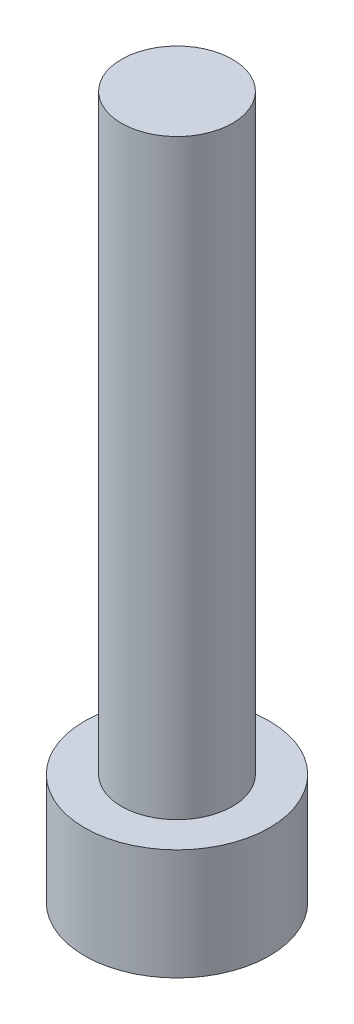
ISO-10303-21;
HEADER;
FILE_DESCRIPTION(('STEP AP214'),'2;1');
FILE_NAME('part.step','',(''),(''),'','','');
FILE_SCHEMA(('AUTOMOTIVE_DESIGN { 1 0 10303 214 1 1 1 1 }'));
ENDSEC;
DATA;
#1=APPLICATION_CONTEXT('core data for automotive mechanical design processes');
#2=APPLICATION_PROTOCOL_DEFINITION('international standard','automotive_design',2000,#1);
#3=PRODUCT_CONTEXT('',#1,'mechanical');
#4=PRODUCT('Part','Part','',(#3));
#5=PRODUCT_RELATED_PRODUCT_CATEGORY('part','',(#4));
#6=PRODUCT_DEFINITION_FORMATION('','',#4);
#7=PRODUCT_DEFINITION_CONTEXT('part definition',#1,'design');
#8=PRODUCT_DEFINITION('design','',#6,#7);
#9=PRODUCT_DEFINITION_SHAPE('','',#8);
#10=(LENGTH_UNIT() NAMED_UNIT(*) SI_UNIT(.MILLI.,.METRE.));
#11=(NAMED_UNIT(*) PLANE_ANGLE_UNIT() SI_UNIT($,.RADIAN.));
#12=(NAMED_UNIT(*) SI_UNIT($,.STERADIAN.) SOLID_ANGLE_UNIT());
#13=UNCERTAINTY_MEASURE_WITH_UNIT(LENGTH_MEASURE(1.E-05),#10,'distance_accuracy_value','');
#14=(GEOMETRIC_REPRESENTATION_CONTEXT(3) GLOBAL_UNCERTAINTY_ASSIGNED_CONTEXT((#13)) GLOBAL_UNIT_ASSIGNED_CONTEXT((#10,
#11,#12)) REPRESENTATION_CONTEXT('',''));
#15=CARTESIAN_POINT('',(0.,0.,0.));
#16=DIRECTION('',(0.,0.,1.));
#17=DIRECTION('',(1.,0.,0.));
#18=AXIS2_PLACEMENT_3D('',#15,#16,#17);
#19=CARTESIAN_POINT('',(0.,3.,0.));
#20=DIRECTION('',(0.,-1.,0.));
#21=DIRECTION('',(0.,0.,-1.));
#22=AXIS2_PLACEMENT_3D('',#19,#20,#21);
#23=CYLINDRICAL_SURFACE('',#22,2.5);
#24=CARTESIAN_POINT('',(0.,3.,0.));
#25=DIRECTION('',(0.,1.,0.));
#26=DIRECTION('',(0.,0.,1.));
#27=AXIS2_PLACEMENT_3D('',#24,#25,#26);
#28=CIRCLE('',#27,2.5);
#29=CARTESIAN_POINT('',(0.,3.,2.5));
#30=VERTEX_POINT('',#29);
#31=EDGE_CURVE('E43',#30,#30,#28,.T.);
#32=ORIENTED_EDGE('',*,*,#31,.F.);
#33=EDGE_LOOP('',(#32));
#34=FACE_BOUND('',#33,.T.);
#35=CARTESIAN_POINT('',(0.,0.,0.));
#36=DIRECTION('',(0.,1.,0.));
#37=DIRECTION('',(0.,0.,1.));
#38=AXIS2_PLACEMENT_3D('',#35,#36,#37);
#39=CIRCLE('',#38,2.5);
#40=CARTESIAN_POINT('',(0.,0.,2.5));
#41=VERTEX_POINT('',#40);
#42=EDGE_CURVE('E38',#41,#41,#39,.T.);
#43=ORIENTED_EDGE('',*,*,#42,.T.);
#44=EDGE_LOOP('',(#43));
#45=FACE_BOUND('',#44,.T.);
#46=ADVANCED_FACE('F35',(#34,#45),#23,.T.);
#47=CARTESIAN_POINT('',(0.,3.,0.));
#48=DIRECTION('',(0.,1.,0.));
#49=DIRECTION('',(0.,0.,1.));
#50=AXIS2_PLACEMENT_3D('',#47,#48,#49);
#51=PLANE('',#50);
#52=CARTESIAN_POINT('',(0.,3.,0.));
#53=DIRECTION('',(0.,1.,0.));
#54=DIRECTION('',(0.,0.,1.));
#55=AXIS2_PLACEMENT_3D('',#52,#53,#54);
#56=CIRCLE('',#55,1.5);
#57=CARTESIAN_POINT('',(0.,3.,1.5));
#58=VERTEX_POINT('',#57);
#59=EDGE_CURVE('E11',#58,#58,#56,.T.);
#60=ORIENTED_EDGE('',*,*,#59,.F.);
#61=EDGE_LOOP('',(#60));
#62=FACE_BOUND('',#61,.T.);
#63=ORIENTED_EDGE('',*,*,#31,.T.);
#64=EDGE_LOOP('',(#63));
#65=FACE_BOUND('',#64,.T.);
#66=ADVANCED_FACE('F155',(#62,#65),#51,.T.);
#67=CARTESIAN_POINT('',(0.,0.,0.));
#68=DIRECTION('',(0.,1.,0.));
#69=DIRECTION('',(0.,0.,1.));
#70=AXIS2_PLACEMENT_3D('',#67,#68,#69);
#71=PLANE('',#70);
#72=DIRECTION('',(-0.5,0.,0.866025403784439));
#73=VECTOR('',#72,1.);
#74=CARTESIAN_POINT('',(1.425,0.,0.));
#75=LINE('',#74,#73);
#76=CARTESIAN_POINT('',(1.425,0.,0.));
#77=VERTEX_POINT('',#76);
#78=CARTESIAN_POINT('',(0.7125,0.,1.23408620039283));
#79=VERTEX_POINT('',#78);
#80=EDGE_CURVE('E125',#77,#79,#75,.T.);
#81=ORIENTED_EDGE('',*,*,#80,.F.);
#82=DIRECTION('',(0.5,0.,0.866025403784439));
#83=VECTOR('',#82,1.);
#84=CARTESIAN_POINT('',(0.7125,0.,-1.23408620039283));
#85=LINE('',#84,#83);
#86=CARTESIAN_POINT('',(0.7125,0.,-1.23408620039283));
#87=VERTEX_POINT('',#86);
#88=EDGE_CURVE('E51',#87,#77,#85,.T.);
#89=ORIENTED_EDGE('',*,*,#88,.F.);
#90=DIRECTION('',(1.,0.,0.));
#91=VECTOR('',#90,1.);
#92=CARTESIAN_POINT('',(-0.7125,0.,-1.23408620039283));
#93=LINE('',#92,#91);
#94=CARTESIAN_POINT('',(-0.7125,0.,-1.23408620039283));
#95=VERTEX_POINT('',#94);
#96=EDGE_CURVE('E134',#95,#87,#93,.T.);
#97=ORIENTED_EDGE('',*,*,#96,.F.);
#98=DIRECTION('',(0.5,0.,-0.866025403784439));
#99=VECTOR('',#98,1.);
#100=CARTESIAN_POINT('',(-1.425,0.,0.));
#101=LINE('',#100,#99);
#102=CARTESIAN_POINT('',(-1.425,0.,0.));
#103=VERTEX_POINT('',#102);
#104=EDGE_CURVE('E132',#103,#95,#101,.T.);
#105=ORIENTED_EDGE('',*,*,#104,.F.);
#106=DIRECTION('',(-0.5,0.,-0.866025403784439));
#107=VECTOR('',#106,1.);
#108=CARTESIAN_POINT('',(-0.7125,0.,1.23408620039283));
#109=LINE('',#108,#107);
#110=CARTESIAN_POINT('',(-0.7125,0.,1.23408620039283));
#111=VERTEX_POINT('',#110);
#112=EDGE_CURVE('E99',#111,#103,#109,.T.);
#113=ORIENTED_EDGE('',*,*,#112,.F.);
#114=DIRECTION('',(-1.,0.,0.));
#115=VECTOR('',#114,1.);
#116=CARTESIAN_POINT('',(0.7125,0.,1.23408620039283));
#117=LINE('',#116,#115);
#118=EDGE_CURVE('E128',#79,#111,#117,.T.);
#119=ORIENTED_EDGE('',*,*,#118,.F.);
#120=EDGE_LOOP('',(#81,#89,#97,#105,#113,#119));
#121=FACE_BOUND('',#120,.T.);
#122=ORIENTED_EDGE('',*,*,#42,.F.);
#123=EDGE_LOOP('',(#122));
#124=FACE_BOUND('',#123,.T.);
#125=ADVANCED_FACE('F152',(#121,#124),#71,.F.);
#126=CARTESIAN_POINT('',(0.,19.,0.));
#127=DIRECTION('',(0.,-1.,0.));
#128=DIRECTION('',(0.,0.,-1.));
#129=AXIS2_PLACEMENT_3D('',#126,#127,#128);
#130=CYLINDRICAL_SURFACE('',#129,1.5);
#131=CARTESIAN_POINT('',(0.,19.,0.));
#132=DIRECTION('',(0.,1.,0.));
#133=DIRECTION('',(0.,0.,1.));
#134=AXIS2_PLACEMENT_3D('',#131,#132,#133);
#135=CIRCLE('',#134,1.5);
#136=CARTESIAN_POINT('',(0.,19.,1.5));
#137=VERTEX_POINT('',#136);
#138=EDGE_CURVE('E138',#137,#137,#135,.T.);
#139=ORIENTED_EDGE('',*,*,#138,.F.);
#140=EDGE_LOOP('',(#139));
#141=FACE_BOUND('',#140,.T.);
#142=ORIENTED_EDGE('',*,*,#59,.T.);
#143=EDGE_LOOP('',(#142));
#144=FACE_BOUND('',#143,.T.);
#145=ADVANCED_FACE('F154',(#141,#144),#130,.T.);
#146=CARTESIAN_POINT('',(0.,19.,0.));
#147=DIRECTION('',(0.,1.,0.));
#148=DIRECTION('',(0.,0.,1.));
#149=AXIS2_PLACEMENT_3D('',#146,#147,#148);
#150=PLANE('',#149);
#151=ORIENTED_EDGE('',*,*,#138,.T.);
#152=EDGE_LOOP('',(#151));
#153=FACE_BOUND('',#152,.T.);
#154=ADVANCED_FACE('F161',(#153),#150,.T.);
#155=CARTESIAN_POINT('',(0.7125,1.65,-1.23408620039283));
#156=DIRECTION('',(0.866025403784439,0.,-0.5));
#157=DIRECTION('',(-0.5,0.,-0.866025403784439));
#158=AXIS2_PLACEMENT_3D('',#155,#156,#157);
#159=PLANE('',#158);
#160=ORIENTED_EDGE('',*,*,#88,.T.);
#161=DIRECTION('',(0.,-1.,0.));
#162=VECTOR('',#161,1.);
#163=CARTESIAN_POINT('',(1.425,1.65,0.));
#164=LINE('',#163,#162);
#165=CARTESIAN_POINT('',(1.425,1.65,0.));
#166=VERTEX_POINT('',#165);
#167=EDGE_CURVE('E81',#166,#77,#164,.T.);
#168=ORIENTED_EDGE('',*,*,#167,.F.);
#169=DIRECTION('',(0.5,0.,0.866025403784439));
#170=VECTOR('',#169,1.);
#171=CARTESIAN_POINT('',(0.7125,1.65,-1.23408620039283));
#172=LINE('',#171,#170);
#173=CARTESIAN_POINT('',(0.7125,1.65,-1.23408620039283));
#174=VERTEX_POINT('',#173);
#175=EDGE_CURVE('E136',#174,#166,#172,.T.);
#176=ORIENTED_EDGE('',*,*,#175,.F.);
#177=DIRECTION('',(0.,-1.,0.));
#178=VECTOR('',#177,1.);
#179=CARTESIAN_POINT('',(0.7125,1.65,-1.23408620039283));
#180=LINE('',#179,#178);
#181=EDGE_CURVE('E59',#174,#87,#180,.T.);
#182=ORIENTED_EDGE('',*,*,#181,.T.);
#183=EDGE_LOOP('',(#160,#168,#176,#182));
#184=FACE_BOUND('',#183,.T.);
#185=ADVANCED_FACE('F190',(#184),#159,.F.);
#186=CARTESIAN_POINT('',(-0.7125,1.65,-1.23408620039283));
#187=DIRECTION('',(0.,0.,-1.));
#188=DIRECTION('',(-1.,0.,0.));
#189=AXIS2_PLACEMENT_3D('',#186,#187,#188);
#190=PLANE('',#189);
#191=ORIENTED_EDGE('',*,*,#96,.T.);
#192=ORIENTED_EDGE('',*,*,#181,.F.);
#193=DIRECTION('',(1.,0.,0.));
#194=VECTOR('',#193,1.);
#195=CARTESIAN_POINT('',(-0.7125,1.65,-1.23408620039283));
#196=LINE('',#195,#194);
#197=CARTESIAN_POINT('',(-0.7125,1.65,-1.23408620039283));
#198=VERTEX_POINT('',#197);
#199=EDGE_CURVE('E111',#198,#174,#196,.T.);
#200=ORIENTED_EDGE('',*,*,#199,.F.);
#201=DIRECTION('',(0.,-1.,0.));
#202=VECTOR('',#201,1.);
#203=CARTESIAN_POINT('',(-0.7125,1.65,-1.23408620039283));
#204=LINE('',#203,#202);
#205=EDGE_CURVE('E103',#198,#95,#204,.T.);
#206=ORIENTED_EDGE('',*,*,#205,.T.);
#207=EDGE_LOOP('',(#191,#192,#200,#206));
#208=FACE_BOUND('',#207,.T.);
#209=ADVANCED_FACE('F204',(#208),#190,.F.);
#210=CARTESIAN_POINT('',(-1.425,1.65,0.));
#211=DIRECTION('',(-0.866025403784439,0.,-0.5));
#212=DIRECTION('',(-0.5,0.,0.866025403784439));
#213=AXIS2_PLACEMENT_3D('',#210,#211,#212);
#214=PLANE('',#213);
#215=ORIENTED_EDGE('',*,*,#104,.T.);
#216=ORIENTED_EDGE('',*,*,#205,.F.);
#217=DIRECTION('',(0.5,0.,-0.866025403784439));
#218=VECTOR('',#217,1.);
#219=CARTESIAN_POINT('',(-1.425,1.65,0.));
#220=LINE('',#219,#218);
#221=CARTESIAN_POINT('',(-1.425,1.65,0.));
#222=VERTEX_POINT('',#221);
#223=EDGE_CURVE('E107',#222,#198,#220,.T.);
#224=ORIENTED_EDGE('',*,*,#223,.F.);
#225=DIRECTION('',(0.,-1.,0.));
#226=VECTOR('',#225,1.);
#227=CARTESIAN_POINT('',(-1.425,1.65,0.));
#228=LINE('',#227,#226);
#229=EDGE_CURVE('E92',#222,#103,#228,.T.);
#230=ORIENTED_EDGE('',*,*,#229,.T.);
#231=EDGE_LOOP('',(#215,#216,#224,#230));
#232=FACE_BOUND('',#231,.T.);
#233=ADVANCED_FACE('F108',(#232),#214,.F.);
#234=CARTESIAN_POINT('',(-0.7125,1.65,1.23408620039283));
#235=DIRECTION('',(-0.866025403784439,0.,0.5));
#236=DIRECTION('',(0.5,0.,0.866025403784439));
#237=AXIS2_PLACEMENT_3D('',#234,#235,#236);
#238=PLANE('',#237);
#239=ORIENTED_EDGE('',*,*,#112,.T.);
#240=ORIENTED_EDGE('',*,*,#229,.F.);
#241=DIRECTION('',(-0.5,0.,-0.866025403784439));
#242=VECTOR('',#241,1.);
#243=CARTESIAN_POINT('',(-0.7125,1.65,1.23408620039283));
#244=LINE('',#243,#242);
#245=CARTESIAN_POINT('',(-0.7125,1.65,1.23408620039283));
#246=VERTEX_POINT('',#245);
#247=EDGE_CURVE('E96',#246,#222,#244,.T.);
#248=ORIENTED_EDGE('',*,*,#247,.F.);
#249=DIRECTION('',(0.,-1.,0.));
#250=VECTOR('',#249,1.);
#251=CARTESIAN_POINT('',(-0.7125,1.65,1.23408620039283));
#252=LINE('',#251,#250);
#253=EDGE_CURVE('E104',#246,#111,#252,.T.);
#254=ORIENTED_EDGE('',*,*,#253,.T.);
#255=EDGE_LOOP('',(#239,#240,#248,#254));
#256=FACE_BOUND('',#255,.T.);
#257=ADVANCED_FACE('F94',(#256),#238,.F.);
#258=CARTESIAN_POINT('',(0.7125,1.65,1.23408620039283));
#259=DIRECTION('',(0.,0.,1.));
#260=DIRECTION('',(1.,0.,0.));
#261=AXIS2_PLACEMENT_3D('',#258,#259,#260);
#262=PLANE('',#261);
#263=ORIENTED_EDGE('',*,*,#118,.T.);
#264=ORIENTED_EDGE('',*,*,#253,.F.);
#265=DIRECTION('',(-1.,0.,0.));
#266=VECTOR('',#265,1.);
#267=CARTESIAN_POINT('',(0.7125,1.65,1.23408620039283));
#268=LINE('',#267,#266);
#269=CARTESIAN_POINT('',(0.7125,1.65,1.23408620039283));
#270=VERTEX_POINT('',#269);
#271=EDGE_CURVE('E117',#270,#246,#268,.T.);
#272=ORIENTED_EDGE('',*,*,#271,.F.);
#273=DIRECTION('',(0.,-1.,0.));
#274=VECTOR('',#273,1.);
#275=CARTESIAN_POINT('',(0.7125,1.65,1.23408620039283));
#276=LINE('',#275,#274);
#277=EDGE_CURVE('E141',#270,#79,#276,.T.);
#278=ORIENTED_EDGE('',*,*,#277,.T.);
#279=EDGE_LOOP('',(#263,#264,#272,#278));
#280=FACE_BOUND('',#279,.T.);
#281=ADVANCED_FACE('F229',(#280),#262,.F.);
#282=CARTESIAN_POINT('',(1.425,1.65,0.));
#283=DIRECTION('',(0.866025403784439,0.,0.5));
#284=DIRECTION('',(0.5,0.,-0.866025403784438));
#285=AXIS2_PLACEMENT_3D('',#282,#283,#284);
#286=PLANE('',#285);
#287=ORIENTED_EDGE('',*,*,#80,.T.);
#288=ORIENTED_EDGE('',*,*,#277,.F.);
#289=DIRECTION('',(-0.5,0.,0.866025403784439));
#290=VECTOR('',#289,1.);
#291=CARTESIAN_POINT('',(1.425,1.65,0.));
#292=LINE('',#291,#290);
#293=EDGE_CURVE('E119',#166,#270,#292,.T.);
#294=ORIENTED_EDGE('',*,*,#293,.F.);
#295=ORIENTED_EDGE('',*,*,#167,.T.);
#296=EDGE_LOOP('',(#287,#288,#294,#295));
#297=FACE_BOUND('',#296,.T.);
#298=ADVANCED_FACE('F238',(#297),#286,.F.);
#299=CARTESIAN_POINT('',(0.,1.65,0.));
#300=DIRECTION('',(0.,-1.,0.));
#301=DIRECTION('',(0.,0.,-1.));
#302=AXIS2_PLACEMENT_3D('',#299,#300,#301);
#303=PLANE('',#302);
#304=ORIENTED_EDGE('',*,*,#175,.T.);
#305=ORIENTED_EDGE('',*,*,#293,.T.);
#306=ORIENTED_EDGE('',*,*,#271,.T.);
#307=ORIENTED_EDGE('',*,*,#247,.T.);
#308=ORIENTED_EDGE('',*,*,#223,.T.);
#309=ORIENTED_EDGE('',*,*,#199,.T.);
#310=EDGE_LOOP('',(#304,#305,#306,#307,#308,#309));
#311=FACE_BOUND('',#310,.T.);
#312=ADVANCED_FACE('F114',(#311),#303,.T.);
#313=CLOSED_SHELL('',(#46,#66,#125,#145,#154,#185,#209,#233,#257,#281,#298,#312));
#314=MANIFOLD_SOLID_BREP('B2',#313);
#315=ADVANCED_BREP_SHAPE_REPRESENTATION('',(#18,#314),#14);
#316=SHAPE_DEFINITION_REPRESENTATION(#9,#315);
ENDSEC;
END-ISO-10303-21;
